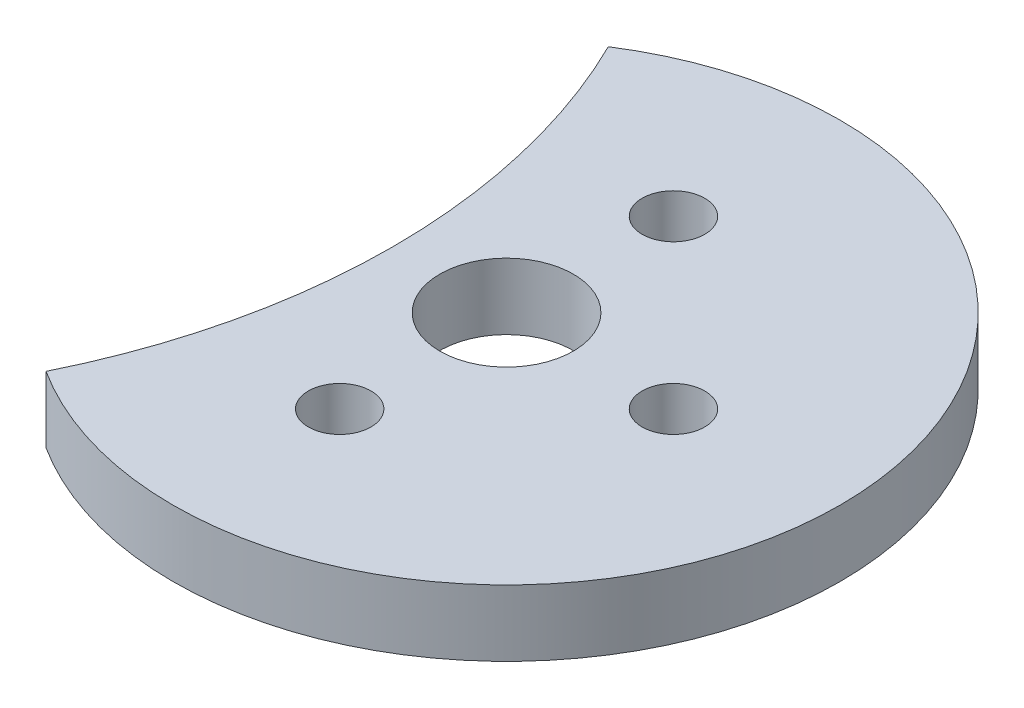
ISO-10303-21;
HEADER;
FILE_DESCRIPTION(('STEP AP214'),'2;1');
FILE_NAME('part.step','',(''),(''),'','','');
FILE_SCHEMA(('AUTOMOTIVE_DESIGN { 1 0 10303 214 1 1 1 1 }'));
ENDSEC;
DATA;
#1=APPLICATION_CONTEXT('core data for automotive mechanical design processes');
#2=APPLICATION_PROTOCOL_DEFINITION('international standard','automotive_design',2000,#1);
#3=PRODUCT_CONTEXT('',#1,'mechanical');
#4=PRODUCT('Part','Part','',(#3));
#5=PRODUCT_RELATED_PRODUCT_CATEGORY('part','',(#4));
#6=PRODUCT_DEFINITION_FORMATION('','',#4);
#7=PRODUCT_DEFINITION_CONTEXT('part definition',#1,'design');
#8=PRODUCT_DEFINITION('design','',#6,#7);
#9=PRODUCT_DEFINITION_SHAPE('','',#8);
#10=(LENGTH_UNIT() NAMED_UNIT(*) SI_UNIT(.MILLI.,.METRE.));
#11=(NAMED_UNIT(*) PLANE_ANGLE_UNIT() SI_UNIT($,.RADIAN.));
#12=(NAMED_UNIT(*) SI_UNIT($,.STERADIAN.) SOLID_ANGLE_UNIT());
#13=UNCERTAINTY_MEASURE_WITH_UNIT(LENGTH_MEASURE(1.E-05),#10,'distance_accuracy_value','');
#14=(GEOMETRIC_REPRESENTATION_CONTEXT(3) GLOBAL_UNCERTAINTY_ASSIGNED_CONTEXT((#13)) GLOBAL_UNIT_ASSIGNED_CONTEXT((#10,
#11,#12)) REPRESENTATION_CONTEXT('',''));
#15=CARTESIAN_POINT('',(0.,0.,0.));
#16=DIRECTION('',(0.,0.,1.));
#17=DIRECTION('',(1.,0.,0.));
#18=AXIS2_PLACEMENT_3D('',#15,#16,#17);
#19=CARTESIAN_POINT('',(0.,3.175,0.));
#20=DIRECTION('',(0.,-1.,0.));
#21=DIRECTION('',(0.,0.,-1.));
#22=AXIS2_PLACEMENT_3D('',#19,#20,#21);
#23=CYLINDRICAL_SURFACE('',#22,15.988284);
#24=CARTESIAN_POINT('',(0.,0.,0.));
#25=DIRECTION('',(0.,1.,0.));
#26=DIRECTION('',(0.,0.,1.));
#27=AXIS2_PLACEMENT_3D('',#24,#25,#26);
#28=CIRCLE('',#27,15.988284);
#29=CARTESIAN_POINT('',(-8.60076417459874,0.,13.477836654211));
#30=VERTEX_POINT('',#29);
#31=CARTESIAN_POINT('',(-8.60076417459874,0.,-13.477836654211));
#32=VERTEX_POINT('',#31);
#33=EDGE_CURVE('E40',#30,#32,#28,.T.);
#34=ORIENTED_EDGE('',*,*,#33,.T.);
#35=DIRECTION('',(0.,1.,0.));
#36=VECTOR('',#35,1.);
#37=CARTESIAN_POINT('',(-8.60076417459874,1.5875,-13.477836654211));
#38=LINE('',#37,#36);
#39=CARTESIAN_POINT('',(-8.60076417459874,3.175,-13.477836654211));
#40=VERTEX_POINT('',#39);
#41=EDGE_CURVE('E51',#32,#40,#38,.T.);
#42=ORIENTED_EDGE('',*,*,#41,.T.);
#43=CARTESIAN_POINT('',(0.,3.175,0.));
#44=DIRECTION('',(0.,1.,0.));
#45=DIRECTION('',(0.,0.,1.));
#46=AXIS2_PLACEMENT_3D('',#43,#44,#45);
#47=CIRCLE('',#46,15.988284);
#48=CARTESIAN_POINT('',(-8.60076417459874,3.175,13.477836654211));
#49=VERTEX_POINT('',#48);
#50=EDGE_CURVE('E11',#49,#40,#47,.T.);
#51=ORIENTED_EDGE('',*,*,#50,.F.);
#52=DIRECTION('',(0.,1.,0.));
#53=VECTOR('',#52,1.);
#54=CARTESIAN_POINT('',(-8.60076417459874,1.5875,13.477836654211));
#55=LINE('',#54,#53);
#56=EDGE_CURVE('E63',#49,#30,#55,.F.);
#57=ORIENTED_EDGE('',*,*,#56,.T.);
#58=EDGE_LOOP('',(#34,#42,#51,#57));
#59=FACE_BOUND('',#58,.T.);
#60=ADVANCED_FACE('F37',(#59),#23,.T.);
#61=CARTESIAN_POINT('',(0.,3.175,0.));
#62=DIRECTION('',(0.,1.,0.));
#63=DIRECTION('',(0.,0.,1.));
#64=AXIS2_PLACEMENT_3D('',#61,#62,#63);
#65=PLANE('',#64);
#66=CARTESIAN_POINT('',(0.,3.175,-7.999984));
#67=DIRECTION('',(0.,1.,0.));
#68=DIRECTION('',(0.,0.,1.));
#69=AXIS2_PLACEMENT_3D('',#66,#67,#68);
#70=CIRCLE('',#69,1.499997);
#71=CARTESIAN_POINT('',(0.,3.175,-6.499987));
#72=VERTEX_POINT('',#71);
#73=EDGE_CURVE('E89',#72,#72,#70,.T.);
#74=ORIENTED_EDGE('',*,*,#73,.F.);
#75=EDGE_LOOP('',(#74));
#76=FACE_BOUND('',#75,.T.);
#77=CARTESIAN_POINT('',(0.,3.175,0.));
#78=DIRECTION('',(0.,1.,0.));
#79=DIRECTION('',(0.,0.,1.));
#80=AXIS2_PLACEMENT_3D('',#77,#78,#79);
#81=CIRCLE('',#80,3.2004);
#82=CARTESIAN_POINT('',(0.,3.175,3.2004));
#83=VERTEX_POINT('',#82);
#84=EDGE_CURVE('E80',#83,#83,#81,.T.);
#85=ORIENTED_EDGE('',*,*,#84,.F.);
#86=EDGE_LOOP('',(#85));
#87=FACE_BOUND('',#86,.T.);
#88=CARTESIAN_POINT('',(7.999984,3.175,0.));
#89=DIRECTION('',(0.,1.,0.));
#90=DIRECTION('',(0.,0.,1.));
#91=AXIS2_PLACEMENT_3D('',#88,#89,#90);
#92=CIRCLE('',#91,1.499997);
#93=CARTESIAN_POINT('',(7.999984,3.175,1.499997));
#94=VERTEX_POINT('',#93);
#95=EDGE_CURVE('E79',#94,#94,#92,.T.);
#96=ORIENTED_EDGE('',*,*,#95,.F.);
#97=EDGE_LOOP('',(#96));
#98=FACE_BOUND('',#97,.T.);
#99=CARTESIAN_POINT('',(0.,3.175,7.999984));
#100=DIRECTION('',(0.,1.,0.));
#101=DIRECTION('',(0.,0.,1.));
#102=AXIS2_PLACEMENT_3D('',#99,#100,#101);
#103=CIRCLE('',#102,1.499997);
#104=CARTESIAN_POINT('',(0.,3.175,9.499981));
#105=VERTEX_POINT('',#104);
#106=EDGE_CURVE('E86',#105,#105,#103,.T.);
#107=ORIENTED_EDGE('',*,*,#106,.F.);
#108=EDGE_LOOP('',(#107));
#109=FACE_BOUND('',#108,.T.);
#110=CARTESIAN_POINT('',(-35.9389850223863,3.175,0.));
#111=DIRECTION('',(0.,1.,0.));
#112=DIRECTION('',(0.,0.,1.));
#113=AXIS2_PLACEMENT_3D('',#110,#111,#112);
#114=CIRCLE('',#113,30.48);
#115=EDGE_CURVE('E56',#49,#40,#114,.T.);
#116=ORIENTED_EDGE('',*,*,#115,.F.);
#117=ORIENTED_EDGE('',*,*,#50,.T.);
#118=EDGE_LOOP('',(#116,#117));
#119=FACE_BOUND('',#118,.T.);
#120=ADVANCED_FACE('F109',(#76,#87,#98,#109,#119),#65,.T.);
#121=CARTESIAN_POINT('',(0.,0.,0.));
#122=DIRECTION('',(0.,1.,0.));
#123=DIRECTION('',(0.,0.,1.));
#124=AXIS2_PLACEMENT_3D('',#121,#122,#123);
#125=PLANE('',#124);
#126=CARTESIAN_POINT('',(0.,0.,-7.999984));
#127=DIRECTION('',(0.,1.,0.));
#128=DIRECTION('',(0.,0.,1.));
#129=AXIS2_PLACEMENT_3D('',#126,#127,#128);
#130=CIRCLE('',#129,1.499997);
#131=CARTESIAN_POINT('',(0.,0.,-6.499987));
#132=VERTEX_POINT('',#131);
#133=EDGE_CURVE('E74',#132,#132,#130,.T.);
#134=ORIENTED_EDGE('',*,*,#133,.T.);
#135=EDGE_LOOP('',(#134));
#136=FACE_BOUND('',#135,.T.);
#137=CARTESIAN_POINT('',(0.,0.,0.));
#138=DIRECTION('',(0.,1.,0.));
#139=DIRECTION('',(0.,0.,1.));
#140=AXIS2_PLACEMENT_3D('',#137,#138,#139);
#141=CIRCLE('',#140,3.2004);
#142=CARTESIAN_POINT('',(0.,0.,3.2004));
#143=VERTEX_POINT('',#142);
#144=EDGE_CURVE('E90',#143,#143,#141,.T.);
#145=ORIENTED_EDGE('',*,*,#144,.T.);
#146=EDGE_LOOP('',(#145));
#147=FACE_BOUND('',#146,.T.);
#148=CARTESIAN_POINT('',(7.999984,0.,0.));
#149=DIRECTION('',(0.,1.,0.));
#150=DIRECTION('',(0.,0.,1.));
#151=AXIS2_PLACEMENT_3D('',#148,#149,#150);
#152=CIRCLE('',#151,1.499997);
#153=CARTESIAN_POINT('',(7.999984,0.,1.499997));
#154=VERTEX_POINT('',#153);
#155=EDGE_CURVE('E76',#154,#154,#152,.T.);
#156=ORIENTED_EDGE('',*,*,#155,.T.);
#157=EDGE_LOOP('',(#156));
#158=FACE_BOUND('',#157,.T.);
#159=CARTESIAN_POINT('',(0.,0.,7.999984));
#160=DIRECTION('',(0.,1.,0.));
#161=DIRECTION('',(0.,0.,1.));
#162=AXIS2_PLACEMENT_3D('',#159,#160,#161);
#163=CIRCLE('',#162,1.499997);
#164=CARTESIAN_POINT('',(0.,0.,9.499981));
#165=VERTEX_POINT('',#164);
#166=EDGE_CURVE('E83',#165,#165,#163,.T.);
#167=ORIENTED_EDGE('',*,*,#166,.T.);
#168=EDGE_LOOP('',(#167));
#169=FACE_BOUND('',#168,.T.);
#170=ORIENTED_EDGE('',*,*,#33,.F.);
#171=CARTESIAN_POINT('',(-35.9389850223863,0.,0.));
#172=DIRECTION('',(0.,1.,0.));
#173=DIRECTION('',(0.,0.,1.));
#174=AXIS2_PLACEMENT_3D('',#171,#172,#173);
#175=CIRCLE('',#174,30.48);
#176=EDGE_CURVE('E60',#30,#32,#175,.T.);
#177=ORIENTED_EDGE('',*,*,#176,.T.);
#178=EDGE_LOOP('',(#170,#177));
#179=FACE_BOUND('',#178,.T.);
#180=ADVANCED_FACE('F71',(#136,#147,#158,#169,#179),#125,.F.);
#181=CARTESIAN_POINT('',(-35.9389850223863,0.,0.));
#182=DIRECTION('',(0.,1.,0.));
#183=DIRECTION('',(0.,0.,1.));
#184=AXIS2_PLACEMENT_3D('',#181,#182,#183);
#185=CYLINDRICAL_SURFACE('',#184,30.48);
#186=ORIENTED_EDGE('',*,*,#176,.F.);
#187=ORIENTED_EDGE('',*,*,#56,.F.);
#188=ORIENTED_EDGE('',*,*,#115,.T.);
#189=ORIENTED_EDGE('',*,*,#41,.F.);
#190=EDGE_LOOP('',(#186,#187,#188,#189));
#191=FACE_BOUND('',#190,.T.);
#192=ADVANCED_FACE('F62',(#191),#185,.F.);
#193=CARTESIAN_POINT('',(0.,0.,7.999984));
#194=DIRECTION('',(0.,1.,0.));
#195=DIRECTION('',(0.,0.,1.));
#196=AXIS2_PLACEMENT_3D('',#193,#194,#195);
#197=CYLINDRICAL_SURFACE('',#196,1.499997);
#198=ORIENTED_EDGE('',*,*,#166,.F.);
#199=EDGE_LOOP('',(#198));
#200=FACE_BOUND('',#199,.T.);
#201=ORIENTED_EDGE('',*,*,#106,.T.);
#202=EDGE_LOOP('',(#201));
#203=FACE_BOUND('',#202,.T.);
#204=ADVANCED_FACE('F120',(#200,#203),#197,.F.);
#205=CARTESIAN_POINT('',(7.999984,0.,0.));
#206=DIRECTION('',(0.,1.,0.));
#207=DIRECTION('',(0.,0.,1.));
#208=AXIS2_PLACEMENT_3D('',#205,#206,#207);
#209=CYLINDRICAL_SURFACE('',#208,1.499997);
#210=ORIENTED_EDGE('',*,*,#155,.F.);
#211=EDGE_LOOP('',(#210));
#212=FACE_BOUND('',#211,.T.);
#213=ORIENTED_EDGE('',*,*,#95,.T.);
#214=EDGE_LOOP('',(#213));
#215=FACE_BOUND('',#214,.T.);
#216=ADVANCED_FACE('F122',(#212,#215),#209,.F.);
#217=CARTESIAN_POINT('',(0.,0.,0.));
#218=DIRECTION('',(0.,1.,0.));
#219=DIRECTION('',(0.,0.,1.));
#220=AXIS2_PLACEMENT_3D('',#217,#218,#219);
#221=CYLINDRICAL_SURFACE('',#220,3.2004);
#222=ORIENTED_EDGE('',*,*,#144,.F.);
#223=EDGE_LOOP('',(#222));
#224=FACE_BOUND('',#223,.T.);
#225=ORIENTED_EDGE('',*,*,#84,.T.);
#226=EDGE_LOOP('',(#225));
#227=FACE_BOUND('',#226,.T.);
#228=ADVANCED_FACE('F105',(#224,#227),#221,.F.);
#229=CARTESIAN_POINT('',(0.,0.,-7.999984));
#230=DIRECTION('',(0.,1.,0.));
#231=DIRECTION('',(0.,0.,1.));
#232=AXIS2_PLACEMENT_3D('',#229,#230,#231);
#233=CYLINDRICAL_SURFACE('',#232,1.499997);
#234=ORIENTED_EDGE('',*,*,#133,.F.);
#235=EDGE_LOOP('',(#234));
#236=FACE_BOUND('',#235,.T.);
#237=ORIENTED_EDGE('',*,*,#73,.T.);
#238=EDGE_LOOP('',(#237));
#239=FACE_BOUND('',#238,.T.);
#240=ADVANCED_FACE('F102',(#236,#239),#233,.F.);
#241=CLOSED_SHELL('',(#60,#120,#180,#192,#204,#216,#228,#240));
#242=MANIFOLD_SOLID_BREP('B2',#241);
#243=ADVANCED_BREP_SHAPE_REPRESENTATION('',(#18,#242),#14);
#244=SHAPE_DEFINITION_REPRESENTATION(#9,#243);
ENDSEC;
END-ISO-10303-21;
